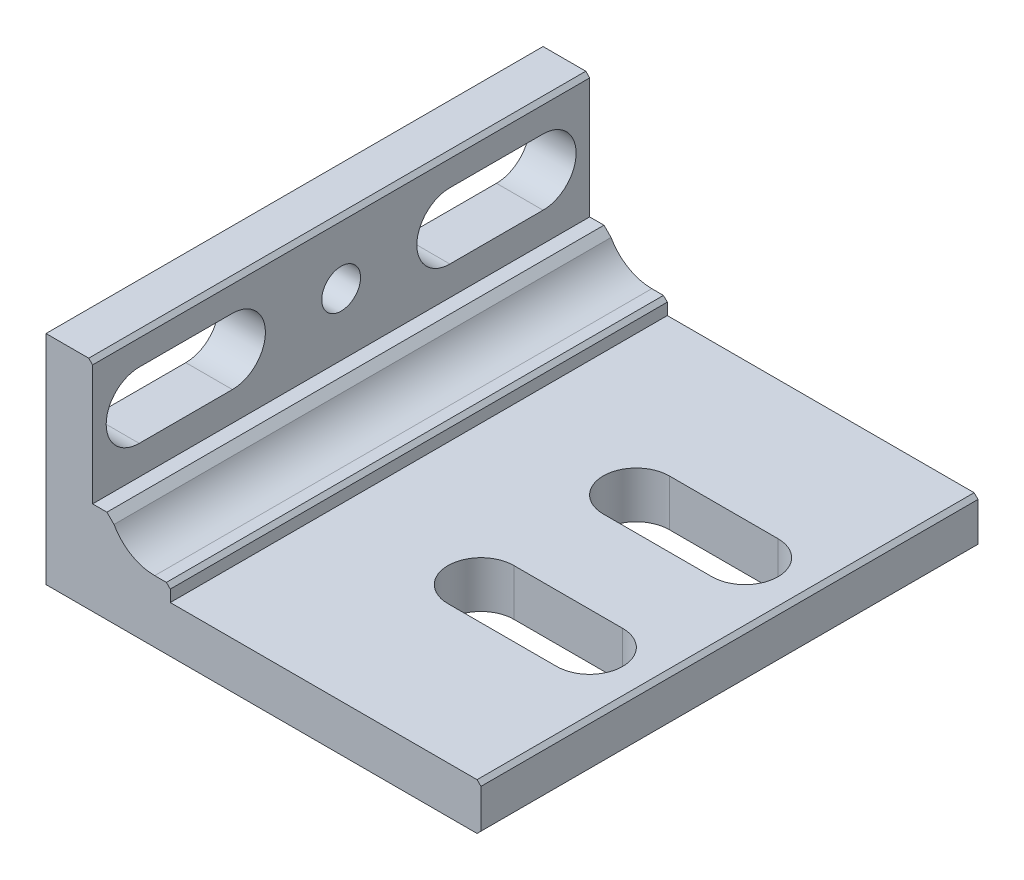
ISO-10303-21;
HEADER;
FILE_DESCRIPTION(('STEP AP214'),'2;1');
FILE_NAME('part.step','',(''),(''),'','','');
FILE_SCHEMA(('AUTOMOTIVE_DESIGN { 1 0 10303 214 1 1 1 1 }'));
ENDSEC;
DATA;
#1=APPLICATION_CONTEXT('core data for automotive mechanical design processes');
#2=APPLICATION_PROTOCOL_DEFINITION('international standard','automotive_design',2000,#1);
#3=PRODUCT_CONTEXT('',#1,'mechanical');
#4=PRODUCT('Part','Part','',(#3));
#5=PRODUCT_RELATED_PRODUCT_CATEGORY('part','',(#4));
#6=PRODUCT_DEFINITION_FORMATION('','',#4);
#7=PRODUCT_DEFINITION_CONTEXT('part definition',#1,'design');
#8=PRODUCT_DEFINITION('design','',#6,#7);
#9=PRODUCT_DEFINITION_SHAPE('','',#8);
#10=(LENGTH_UNIT() NAMED_UNIT(*) SI_UNIT(.MILLI.,.METRE.));
#11=(NAMED_UNIT(*) PLANE_ANGLE_UNIT() SI_UNIT($,.RADIAN.));
#12=(NAMED_UNIT(*) SI_UNIT($,.STERADIAN.) SOLID_ANGLE_UNIT());
#13=UNCERTAINTY_MEASURE_WITH_UNIT(LENGTH_MEASURE(1.E-05),#10,'distance_accuracy_value','');
#14=(GEOMETRIC_REPRESENTATION_CONTEXT(3) GLOBAL_UNCERTAINTY_ASSIGNED_CONTEXT((#13)) GLOBAL_UNIT_ASSIGNED_CONTEXT((#10,
#11,#12)) REPRESENTATION_CONTEXT('',''));
#15=CARTESIAN_POINT('',(0.,0.,0.));
#16=DIRECTION('',(0.,0.,1.));
#17=DIRECTION('',(1.,0.,0.));
#18=AXIS2_PLACEMENT_3D('',#15,#16,#17);
#19=CARTESIAN_POINT('',(0.,0.,50.8));
#20=DIRECTION('',(1.,0.,0.));
#21=DIRECTION('',(0.,0.,-1.));
#22=AXIS2_PLACEMENT_3D('',#19,#20,#21);
#23=PLANE('',#22);
#24=CARTESIAN_POINT('',(0.,31.75,0.));
#25=DIRECTION('',(1.,0.,0.));
#26=DIRECTION('',(0.,0.,-1.));
#27=AXIS2_PLACEMENT_3D('',#24,#25,#26);
#28=CIRCLE('',#27,3.96874999999999);
#29=CARTESIAN_POINT('',(0.,31.75,-3.96874999999999));
#30=VERTEX_POINT('',#29);
#31=EDGE_CURVE('E724',#30,#30,#28,.T.);
#32=ORIENTED_EDGE('',*,*,#31,.T.);
#33=EDGE_LOOP('',(#32));
#34=FACE_BOUND('',#33,.T.);
#35=DIRECTION('',(0.,0.,1.));
#36=VECTOR('',#35,1.);
#37=CARTESIAN_POINT('',(0.,44.45,50.8));
#38=LINE('',#37,#36);
#39=CARTESIAN_POINT('',(0.,44.45,-50.8));
#40=VERTEX_POINT('',#39);
#41=CARTESIAN_POINT('',(0.,44.45,50.8));
#42=VERTEX_POINT('',#41);
#43=EDGE_CURVE('E398',#40,#42,#38,.T.);
#44=ORIENTED_EDGE('',*,*,#43,.F.);
#45=DIRECTION('',(0.,-1.,0.));
#46=VECTOR('',#45,1.);
#47=CARTESIAN_POINT('',(0.,0.,-50.8));
#48=LINE('',#47,#46);
#49=CARTESIAN_POINT('',(0.,0.,-50.8));
#50=VERTEX_POINT('',#49);
#51=EDGE_CURVE('E408',#40,#50,#48,.T.);
#52=ORIENTED_EDGE('',*,*,#51,.T.);
#53=DIRECTION('',(0.,0.,-1.));
#54=VECTOR('',#53,1.);
#55=CARTESIAN_POINT('',(0.,0.,50.8));
#56=LINE('',#55,#54);
#57=CARTESIAN_POINT('',(0.,0.,50.8));
#58=VERTEX_POINT('',#57);
#59=EDGE_CURVE('E415',#58,#50,#56,.T.);
#60=ORIENTED_EDGE('',*,*,#59,.F.);
#61=DIRECTION('',(0.,-1.,0.));
#62=VECTOR('',#61,1.);
#63=CARTESIAN_POINT('',(0.,0.,50.8));
#64=LINE('',#63,#62);
#65=EDGE_CURVE('E413',#42,#58,#64,.T.);
#66=ORIENTED_EDGE('',*,*,#65,.F.);
#67=EDGE_LOOP('',(#44,#52,#60,#66));
#68=FACE_BOUND('',#67,.T.);
#69=DIRECTION('',(0.,0.,1.));
#70=VECTOR('',#69,1.);
#71=CARTESIAN_POINT('',(0.,38.496875,-22.225));
#72=LINE('',#71,#70);
#73=CARTESIAN_POINT('',(0.,38.496875,-41.275));
#74=VERTEX_POINT('',#73);
#75=CARTESIAN_POINT('',(0.,38.496875,-22.225));
#76=VERTEX_POINT('',#75);
#77=EDGE_CURVE('E282',#74,#76,#72,.T.);
#78=ORIENTED_EDGE('',*,*,#77,.T.);
#79=CARTESIAN_POINT('',(0.,31.75,-22.225));
#80=DIRECTION('',(1.,0.,0.));
#81=DIRECTION('',(0.,1.,0.));
#82=AXIS2_PLACEMENT_3D('',#79,#80,#81);
#83=CIRCLE('',#82,6.74687499999999);
#84=CARTESIAN_POINT('',(0.,25.003125,-22.225));
#85=VERTEX_POINT('',#84);
#86=EDGE_CURVE('E272',#76,#85,#83,.T.);
#87=ORIENTED_EDGE('',*,*,#86,.T.);
#88=DIRECTION('',(0.,0.,-1.));
#89=VECTOR('',#88,1.);
#90=CARTESIAN_POINT('',(0.,25.003125,-22.225));
#91=LINE('',#90,#89);
#92=CARTESIAN_POINT('',(0.,25.003125,-41.275));
#93=VERTEX_POINT('',#92);
#94=EDGE_CURVE('E275',#85,#93,#91,.T.);
#95=ORIENTED_EDGE('',*,*,#94,.T.);
#96=CARTESIAN_POINT('',(0.,31.75,-41.275));
#97=DIRECTION('',(1.,0.,0.));
#98=DIRECTION('',(0.,1.,0.));
#99=AXIS2_PLACEMENT_3D('',#96,#97,#98);
#100=CIRCLE('',#99,6.74687499999999);
#101=EDGE_CURVE('E279',#93,#74,#100,.T.);
#102=ORIENTED_EDGE('',*,*,#101,.T.);
#103=EDGE_LOOP('',(#78,#87,#95,#102));
#104=FACE_BOUND('',#103,.T.);
#105=CARTESIAN_POINT('',(0.,31.75,22.225));
#106=DIRECTION('',(-1.,0.,0.));
#107=DIRECTION('',(0.,1.,0.));
#108=AXIS2_PLACEMENT_3D('',#105,#106,#107);
#109=CIRCLE('',#108,6.74687499999999);
#110=CARTESIAN_POINT('',(0.,38.496875,22.225));
#111=VERTEX_POINT('',#110);
#112=CARTESIAN_POINT('',(0.,25.003125,22.225));
#113=VERTEX_POINT('',#112);
#114=EDGE_CURVE('E243',#111,#113,#109,.T.);
#115=ORIENTED_EDGE('',*,*,#114,.F.);
#116=DIRECTION('',(0.,0.,-1.));
#117=VECTOR('',#116,1.);
#118=CARTESIAN_POINT('',(0.,38.496875,22.225));
#119=LINE('',#118,#117);
#120=CARTESIAN_POINT('',(0.,38.496875,41.275));
#121=VERTEX_POINT('',#120);
#122=EDGE_CURVE('E235',#121,#111,#119,.T.);
#123=ORIENTED_EDGE('',*,*,#122,.F.);
#124=CARTESIAN_POINT('',(0.,31.75,41.275));
#125=DIRECTION('',(-1.,0.,0.));
#126=DIRECTION('',(0.,1.,0.));
#127=AXIS2_PLACEMENT_3D('',#124,#125,#126);
#128=CIRCLE('',#127,6.74687499999999);
#129=CARTESIAN_POINT('',(0.,25.003125,41.275));
#130=VERTEX_POINT('',#129);
#131=EDGE_CURVE('E242',#130,#121,#128,.T.);
#132=ORIENTED_EDGE('',*,*,#131,.F.);
#133=DIRECTION('',(0.,0.,1.));
#134=VECTOR('',#133,1.);
#135=CARTESIAN_POINT('',(0.,25.003125,22.225));
#136=LINE('',#135,#134);
#137=EDGE_CURVE('E247',#113,#130,#136,.T.);
#138=ORIENTED_EDGE('',*,*,#137,.F.);
#139=EDGE_LOOP('',(#115,#123,#132,#138));
#140=FACE_BOUND('',#139,.T.);
#141=ADVANCED_FACE('F32',(#34,#68,#104,#140),#23,.F.);
#142=CARTESIAN_POINT('',(9.52500000000001,47.625,50.8));
#143=DIRECTION('',(-1.,0.,0.));
#144=DIRECTION('',(0.,-1.,0.));
#145=AXIS2_PLACEMENT_3D('',#142,#143,#144);
#146=PLANE('',#145);
#147=CARTESIAN_POINT('',(9.52500000000001,31.75,0.));
#148=DIRECTION('',(1.,0.,0.));
#149=DIRECTION('',(0.,0.,-1.));
#150=AXIS2_PLACEMENT_3D('',#147,#148,#149);
#151=CIRCLE('',#150,3.96874999999999);
#152=CARTESIAN_POINT('',(9.52500000000001,31.75,-3.96874999999999));
#153=VERTEX_POINT('',#152);
#154=EDGE_CURVE('E256',#153,#153,#151,.T.);
#155=ORIENTED_EDGE('',*,*,#154,.F.);
#156=EDGE_LOOP('',(#155));
#157=FACE_BOUND('',#156,.T.);
#158=DIRECTION('',(0.,1.,0.));
#159=VECTOR('',#158,1.);
#160=CARTESIAN_POINT('',(9.52500000000001,47.625,-50.8));
#161=LINE('',#160,#159);
#162=CARTESIAN_POINT('',(9.525,19.05,-50.8));
#163=VERTEX_POINT('',#162);
#164=CARTESIAN_POINT('',(9.52500000000001,43.65625,-50.8));
#165=VERTEX_POINT('',#164);
#166=EDGE_CURVE('E307',#163,#165,#161,.T.);
#167=ORIENTED_EDGE('',*,*,#166,.T.);
#168=DIRECTION('',(0.,0.,1.));
#169=VECTOR('',#168,1.);
#170=CARTESIAN_POINT('',(9.52500000000001,43.65625,50.8));
#171=LINE('',#170,#169);
#172=CARTESIAN_POINT('',(9.52500000000001,43.65625,50.8));
#173=VERTEX_POINT('',#172);
#174=EDGE_CURVE('E434',#165,#173,#171,.T.);
#175=ORIENTED_EDGE('',*,*,#174,.T.);
#176=DIRECTION('',(0.,1.,0.));
#177=VECTOR('',#176,1.);
#178=CARTESIAN_POINT('',(9.52500000000001,47.625,50.8));
#179=LINE('',#178,#177);
#180=CARTESIAN_POINT('',(9.525,19.05,50.8));
#181=VERTEX_POINT('',#180);
#182=EDGE_CURVE('E306',#181,#173,#179,.T.);
#183=ORIENTED_EDGE('',*,*,#182,.F.);
#184=DIRECTION('',(0.,0.,-1.));
#185=VECTOR('',#184,1.);
#186=CARTESIAN_POINT('',(9.525,19.05,50.8));
#187=LINE('',#186,#185);
#188=EDGE_CURVE('E310',#181,#163,#187,.T.);
#189=ORIENTED_EDGE('',*,*,#188,.T.);
#190=EDGE_LOOP('',(#167,#175,#183,#189));
#191=FACE_BOUND('',#190,.T.);
#192=DIRECTION('',(0.,0.,-1.));
#193=VECTOR('',#192,1.);
#194=CARTESIAN_POINT('',(9.525,25.003125,-22.225));
#195=LINE('',#194,#193);
#196=CARTESIAN_POINT('',(9.525,25.003125,-22.225));
#197=VERTEX_POINT('',#196);
#198=CARTESIAN_POINT('',(9.525,25.003125,-41.275));
#199=VERTEX_POINT('',#198);
#200=EDGE_CURVE('E287',#197,#199,#195,.T.);
#201=ORIENTED_EDGE('',*,*,#200,.F.);
#202=CARTESIAN_POINT('',(9.525,31.75,-22.225));
#203=DIRECTION('',(1.,0.,0.));
#204=DIRECTION('',(0.,1.,0.));
#205=AXIS2_PLACEMENT_3D('',#202,#203,#204);
#206=CIRCLE('',#205,6.74687499999999);
#207=CARTESIAN_POINT('',(9.52500000000001,38.496875,-22.225));
#208=VERTEX_POINT('',#207);
#209=EDGE_CURVE('E268',#208,#197,#206,.T.);
#210=ORIENTED_EDGE('',*,*,#209,.F.);
#211=DIRECTION('',(0.,0.,1.));
#212=VECTOR('',#211,1.);
#213=CARTESIAN_POINT('',(9.52500000000001,38.496875,-22.225));
#214=LINE('',#213,#212);
#215=CARTESIAN_POINT('',(9.525,38.496875,-41.275));
#216=VERTEX_POINT('',#215);
#217=EDGE_CURVE('E276',#216,#208,#214,.T.);
#218=ORIENTED_EDGE('',*,*,#217,.F.);
#219=CARTESIAN_POINT('',(9.525,31.75,-41.275));
#220=DIRECTION('',(1.,0.,0.));
#221=DIRECTION('',(0.,1.,0.));
#222=AXIS2_PLACEMENT_3D('',#219,#220,#221);
#223=CIRCLE('',#222,6.74687499999999);
#224=EDGE_CURVE('E290',#199,#216,#223,.T.);
#225=ORIENTED_EDGE('',*,*,#224,.F.);
#226=EDGE_LOOP('',(#201,#210,#218,#225));
#227=FACE_BOUND('',#226,.T.);
#228=CARTESIAN_POINT('',(9.525,31.75,22.225));
#229=DIRECTION('',(-1.,0.,0.));
#230=DIRECTION('',(0.,1.,0.));
#231=AXIS2_PLACEMENT_3D('',#228,#229,#230);
#232=CIRCLE('',#231,6.74687499999999);
#233=CARTESIAN_POINT('',(9.525,38.496875,22.225));
#234=VERTEX_POINT('',#233);
#235=CARTESIAN_POINT('',(9.525,25.003125,22.225));
#236=VERTEX_POINT('',#235);
#237=EDGE_CURVE('E55',#234,#236,#232,.T.);
#238=ORIENTED_EDGE('',*,*,#237,.T.);
#239=DIRECTION('',(0.,0.,1.));
#240=VECTOR('',#239,1.);
#241=CARTESIAN_POINT('',(9.525,25.003125,22.225));
#242=LINE('',#241,#240);
#243=CARTESIAN_POINT('',(9.525,25.003125,41.275));
#244=VERTEX_POINT('',#243);
#245=EDGE_CURVE('E250',#236,#244,#242,.T.);
#246=ORIENTED_EDGE('',*,*,#245,.T.);
#247=CARTESIAN_POINT('',(9.525,31.75,41.275));
#248=DIRECTION('',(-1.,0.,0.));
#249=DIRECTION('',(0.,1.,0.));
#250=AXIS2_PLACEMENT_3D('',#247,#248,#249);
#251=CIRCLE('',#250,6.74687499999999);
#252=CARTESIAN_POINT('',(9.525,38.496875,41.275));
#253=VERTEX_POINT('',#252);
#254=EDGE_CURVE('E253',#244,#253,#251,.T.);
#255=ORIENTED_EDGE('',*,*,#254,.T.);
#256=DIRECTION('',(0.,0.,-1.));
#257=VECTOR('',#256,1.);
#258=CARTESIAN_POINT('',(9.52500000000001,38.496875,22.225));
#259=LINE('',#258,#257);
#260=EDGE_CURVE('E262',#253,#234,#259,.T.);
#261=ORIENTED_EDGE('',*,*,#260,.T.);
#262=EDGE_LOOP('',(#238,#246,#255,#261));
#263=FACE_BOUND('',#262,.T.);
#264=ADVANCED_FACE('F534',(#157,#191,#227,#263),#146,.F.);
#265=CARTESIAN_POINT('',(101.6,0.,50.8));
#266=DIRECTION('',(0.,1.,0.));
#267=DIRECTION('',(-1.,0.,0.));
#268=AXIS2_PLACEMENT_3D('',#265,#266,#267);
#269=PLANE('',#268);
#270=DIRECTION('',(1.,0.,0.));
#271=VECTOR('',#270,1.);
#272=CARTESIAN_POINT('',(101.6,0.,-50.8));
#273=LINE('',#272,#271);
#274=CARTESIAN_POINT('',(88.10625,0.,-50.8));
#275=VERTEX_POINT('',#274);
#276=EDGE_CURVE('E403',#50,#275,#273,.T.);
#277=ORIENTED_EDGE('',*,*,#276,.T.);
#278=DIRECTION('',(0.,0.,1.));
#279=VECTOR('',#278,1.);
#280=CARTESIAN_POINT('',(88.10625,0.,50.8));
#281=LINE('',#280,#279);
#282=CARTESIAN_POINT('',(88.10625,0.,50.8));
#283=VERTEX_POINT('',#282);
#284=EDGE_CURVE('E40',#275,#283,#281,.T.);
#285=ORIENTED_EDGE('',*,*,#284,.T.);
#286=DIRECTION('',(1.,0.,0.));
#287=VECTOR('',#286,1.);
#288=CARTESIAN_POINT('',(101.6,0.,50.8));
#289=LINE('',#288,#287);
#290=EDGE_CURVE('E404',#58,#283,#289,.T.);
#291=ORIENTED_EDGE('',*,*,#290,.F.);
#292=ORIENTED_EDGE('',*,*,#59,.T.);
#293=EDGE_LOOP('',(#277,#285,#291,#292));
#294=FACE_BOUND('',#293,.T.);
#295=DIRECTION('',(1.,0.,0.));
#296=VECTOR('',#295,1.);
#297=CARTESIAN_POINT('',(53.975,0.,-9.12875999999999));
#298=LINE('',#297,#296);
#299=CARTESIAN_POINT('',(53.975,0.,-9.12875999999999));
#300=VERTEX_POINT('',#299);
#301=CARTESIAN_POINT('',(76.2,0.,-9.12876));
#302=VERTEX_POINT('',#301);
#303=EDGE_CURVE('E377',#300,#302,#298,.T.);
#304=ORIENTED_EDGE('',*,*,#303,.T.);
#305=CARTESIAN_POINT('',(76.2,0.,-15.875));
#306=DIRECTION('',(0.,1.,0.));
#307=DIRECTION('',(0.,0.,1.));
#308=AXIS2_PLACEMENT_3D('',#305,#306,#307);
#309=CIRCLE('',#308,6.74624);
#310=CARTESIAN_POINT('',(76.2,0.,-22.62124));
#311=VERTEX_POINT('',#310);
#312=EDGE_CURVE('E360',#302,#311,#309,.T.);
#313=ORIENTED_EDGE('',*,*,#312,.T.);
#314=DIRECTION('',(-1.,0.,0.));
#315=VECTOR('',#314,1.);
#316=CARTESIAN_POINT('',(76.2,0.,-22.62124));
#317=LINE('',#316,#315);
#318=CARTESIAN_POINT('',(53.975,0.,-22.62124));
#319=VERTEX_POINT('',#318);
#320=EDGE_CURVE('E371',#311,#319,#317,.T.);
#321=ORIENTED_EDGE('',*,*,#320,.T.);
#322=CARTESIAN_POINT('',(53.975,0.,-15.875));
#323=DIRECTION('',(0.,1.,0.));
#324=DIRECTION('',(0.,0.,1.));
#325=AXIS2_PLACEMENT_3D('',#322,#323,#324);
#326=CIRCLE('',#325,6.74624000000001);
#327=EDGE_CURVE('E374',#319,#300,#326,.T.);
#328=ORIENTED_EDGE('',*,*,#327,.T.);
#329=EDGE_LOOP('',(#304,#313,#321,#328));
#330=FACE_BOUND('',#329,.T.);
#331=CARTESIAN_POINT('',(76.2,0.,15.875));
#332=DIRECTION('',(0.,-1.,0.));
#333=DIRECTION('',(0.,0.,-1.));
#334=AXIS2_PLACEMENT_3D('',#331,#332,#333);
#335=CIRCLE('',#334,6.74624);
#336=CARTESIAN_POINT('',(76.2,0.,9.12876));
#337=VERTEX_POINT('',#336);
#338=CARTESIAN_POINT('',(76.2,0.,22.62124));
#339=VERTEX_POINT('',#338);
#340=EDGE_CURVE('E347',#337,#339,#335,.T.);
#341=ORIENTED_EDGE('',*,*,#340,.F.);
#342=DIRECTION('',(1.,0.,0.));
#343=VECTOR('',#342,1.);
#344=CARTESIAN_POINT('',(53.975,0.,9.12875999999999));
#345=LINE('',#344,#343);
#346=CARTESIAN_POINT('',(53.975,0.,9.12875999999999));
#347=VERTEX_POINT('',#346);
#348=EDGE_CURVE('E349',#347,#337,#345,.T.);
#349=ORIENTED_EDGE('',*,*,#348,.F.);
#350=CARTESIAN_POINT('',(53.975,0.,15.875));
#351=DIRECTION('',(0.,-1.,0.));
#352=DIRECTION('',(0.,0.,-1.));
#353=AXIS2_PLACEMENT_3D('',#350,#351,#352);
#354=CIRCLE('',#353,6.74624000000001);
#355=CARTESIAN_POINT('',(53.975,0.,22.62124));
#356=VERTEX_POINT('',#355);
#357=EDGE_CURVE('E351',#356,#347,#354,.T.);
#358=ORIENTED_EDGE('',*,*,#357,.F.);
#359=DIRECTION('',(-1.,0.,0.));
#360=VECTOR('',#359,1.);
#361=CARTESIAN_POINT('',(76.2,0.,22.62124));
#362=LINE('',#361,#360);
#363=EDGE_CURVE('E354',#339,#356,#362,.T.);
#364=ORIENTED_EDGE('',*,*,#363,.F.);
#365=EDGE_LOOP('',(#341,#349,#358,#364));
#366=FACE_BOUND('',#365,.T.);
#367=ADVANCED_FACE('F476',(#294,#330,#366),#269,.F.);
#368=CARTESIAN_POINT('',(22.225,12.7,50.8));
#369=DIRECTION('',(0.,-1.,0.));
#370=DIRECTION('',(0.,0.,-1.));
#371=AXIS2_PLACEMENT_3D('',#368,#369,#370);
#372=PLANE('',#371);
#373=DIRECTION('',(-1.,0.,0.));
#374=VECTOR('',#373,1.);
#375=CARTESIAN_POINT('',(22.225,12.7,50.8));
#376=LINE('',#375,#374);
#377=CARTESIAN_POINT('',(24.60625,12.7,50.8));
#378=VERTEX_POINT('',#377);
#379=CARTESIAN_POINT('',(22.225,12.7,50.8));
#380=VERTEX_POINT('',#379);
#381=EDGE_CURVE('E407',#378,#380,#376,.T.);
#382=ORIENTED_EDGE('',*,*,#381,.F.);
#383=DIRECTION('',(0.,0.,-1.));
#384=VECTOR('',#383,1.);
#385=CARTESIAN_POINT('',(24.60625,12.7,50.8));
#386=LINE('',#385,#384);
#387=CARTESIAN_POINT('',(24.60625,12.7,-50.8));
#388=VERTEX_POINT('',#387);
#389=EDGE_CURVE('E464',#378,#388,#386,.T.);
#390=ORIENTED_EDGE('',*,*,#389,.T.);
#391=DIRECTION('',(-1.,0.,0.));
#392=VECTOR('',#391,1.);
#393=CARTESIAN_POINT('',(22.225,12.7,-50.8));
#394=LINE('',#393,#392);
#395=CARTESIAN_POINT('',(22.225,12.7,-50.8));
#396=VERTEX_POINT('',#395);
#397=EDGE_CURVE('E418',#388,#396,#394,.T.);
#398=ORIENTED_EDGE('',*,*,#397,.T.);
#399=DIRECTION('',(0.,0.,-1.));
#400=VECTOR('',#399,1.);
#401=CARTESIAN_POINT('',(22.225,12.7,50.8));
#402=LINE('',#401,#400);
#403=EDGE_CURVE('E426',#380,#396,#402,.T.);
#404=ORIENTED_EDGE('',*,*,#403,.F.);
#405=EDGE_LOOP('',(#382,#390,#398,#404));
#406=FACE_BOUND('',#405,.T.);
#407=ADVANCED_FACE('F515',(#406),#372,.F.);
#408=CARTESIAN_POINT('',(3.18008,92.08008,50.8));
#409=DIRECTION('',(0.,0.,-1.));
#410=DIRECTION('',(-1.,0.,0.));
#411=AXIS2_PLACEMENT_3D('',#408,#409,#410);
#412=PLANE('',#411);
#413=ORIENTED_EDGE('',*,*,#182,.T.);
#414=DIRECTION('',(-0.707106781186546,0.707106781186549,0.));
#415=VECTOR('',#414,1.);
#416=CARTESIAN_POINT('',(9.52500000000001,43.65625,50.8));
#417=LINE('',#416,#415);
#418=CARTESIAN_POINT('',(8.73125000000001,44.45,50.8));
#419=VERTEX_POINT('',#418);
#420=EDGE_CURVE('E445',#173,#419,#417,.T.);
#421=ORIENTED_EDGE('',*,*,#420,.T.);
#422=DIRECTION('',(1.,0.,0.));
#423=VECTOR('',#422,1.);
#424=CARTESIAN_POINT('',(3.18008,44.45,50.8));
#425=LINE('',#424,#423);
#426=EDGE_CURVE('E400',#42,#419,#425,.T.);
#427=ORIENTED_EDGE('',*,*,#426,.F.);
#428=ORIENTED_EDGE('',*,*,#65,.T.);
#429=ORIENTED_EDGE('',*,*,#290,.T.);
#430=DIRECTION('',(0.707106781186547,0.707106781186548,0.));
#431=VECTOR('',#430,1.);
#432=CARTESIAN_POINT('',(88.9,0.793750000000003,50.8));
#433=LINE('',#432,#431);
#434=CARTESIAN_POINT('',(88.9,0.793750000000018,50.8));
#435=VERTEX_POINT('',#434);
#436=EDGE_CURVE('E439',#283,#435,#433,.T.);
#437=ORIENTED_EDGE('',*,*,#436,.T.);
#438=DIRECTION('',(0.,-1.,0.));
#439=VECTOR('',#438,1.);
#440=CARTESIAN_POINT('',(88.9,92.08008,50.8));
#441=LINE('',#440,#439);
#442=CARTESIAN_POINT('',(88.9,8.73125000000003,50.8));
#443=VERTEX_POINT('',#442);
#444=EDGE_CURVE('E395',#443,#435,#441,.T.);
#445=ORIENTED_EDGE('',*,*,#444,.F.);
#446=DIRECTION('',(-0.707106781186546,0.707106781186549,0.));
#447=VECTOR('',#446,1.);
#448=CARTESIAN_POINT('',(88.10625,9.525,50.8));
#449=LINE('',#448,#447);
#450=CARTESIAN_POINT('',(88.10625,9.525,50.8));
#451=VERTEX_POINT('',#450);
#452=EDGE_CURVE('E437',#443,#451,#449,.T.);
#453=ORIENTED_EDGE('',*,*,#452,.T.);
#454=DIRECTION('',(-1.,0.,0.));
#455=VECTOR('',#454,1.);
#456=CARTESIAN_POINT('',(92.075,9.525,50.8));
#457=LINE('',#456,#455);
#458=CARTESIAN_POINT('',(25.4,9.525,50.8));
#459=VERTEX_POINT('',#458);
#460=EDGE_CURVE('E317',#451,#459,#457,.T.);
#461=ORIENTED_EDGE('',*,*,#460,.T.);
#462=DIRECTION('',(0.,1.,0.));
#463=VECTOR('',#462,1.);
#464=CARTESIAN_POINT('',(25.4,15.875,50.8));
#465=LINE('',#464,#463);
#466=CARTESIAN_POINT('',(25.4,11.90625,50.8));
#467=VERTEX_POINT('',#466);
#468=EDGE_CURVE('E319',#459,#467,#465,.T.);
#469=ORIENTED_EDGE('',*,*,#468,.T.);
#470=DIRECTION('',(0.707106781186546,-0.707106781186549,0.));
#471=VECTOR('',#470,1.);
#472=CARTESIAN_POINT('',(24.60625,12.7,50.8));
#473=LINE('',#472,#471);
#474=EDGE_CURVE('E441',#467,#378,#473,.F.);
#475=ORIENTED_EDGE('',*,*,#474,.T.);
#476=ORIENTED_EDGE('',*,*,#381,.T.);
#477=CARTESIAN_POINT('',(22.225,22.225,50.8));
#478=DIRECTION('',(0.,0.,-1.));
#479=DIRECTION('',(-1.,0.,0.));
#480=AXIS2_PLACEMENT_3D('',#477,#478,#479);
#481=CIRCLE('',#480,9.525);
#482=CARTESIAN_POINT('',(13.894796904673,17.6061969742578,50.8));
#483=VERTEX_POINT('',#482);
#484=EDGE_CURVE('E410',#380,#483,#481,.T.);
#485=ORIENTED_EDGE('',*,*,#484,.T.);
#486=DIRECTION('',(-0.70710678118655,0.707106781186545,0.));
#487=VECTOR('',#486,1.);
#488=CARTESIAN_POINT('',(13.894796904673,17.6061969742578,50.8));
#489=LINE('',#488,#487);
#490=CARTESIAN_POINT('',(12.4509938789308,19.05,50.8));
#491=VERTEX_POINT('',#490);
#492=EDGE_CURVE('E443',#483,#491,#489,.T.);
#493=ORIENTED_EDGE('',*,*,#492,.T.);
#494=DIRECTION('',(-1.,0.,0.));
#495=VECTOR('',#494,1.);
#496=CARTESIAN_POINT('',(19.05,19.05,50.8));
#497=LINE('',#496,#495);
#498=EDGE_CURVE('E304',#491,#181,#497,.T.);
#499=ORIENTED_EDGE('',*,*,#498,.T.);
#500=EDGE_LOOP('',(#413,#421,#427,#428,#429,#437,#445,#453,#461,#469,#475,#476,#485,#493,#499));
#501=FACE_BOUND('',#500,.T.);
#502=ADVANCED_FACE('F482',(#501),#412,.F.);
#503=CARTESIAN_POINT('',(3.18008,92.08008,-50.8));
#504=DIRECTION('',(0.,0.,-1.));
#505=DIRECTION('',(-1.,0.,0.));
#506=AXIS2_PLACEMENT_3D('',#503,#504,#505);
#507=PLANE('',#506);
#508=DIRECTION('',(1.,0.,0.));
#509=VECTOR('',#508,1.);
#510=CARTESIAN_POINT('',(3.18008,44.45,-50.8));
#511=LINE('',#510,#509);
#512=CARTESIAN_POINT('',(8.73125000000002,44.45,-50.8));
#513=VERTEX_POINT('',#512);
#514=EDGE_CURVE('E429',#40,#513,#511,.T.);
#515=ORIENTED_EDGE('',*,*,#514,.T.);
#516=DIRECTION('',(0.707106781186546,-0.707106781186549,0.));
#517=VECTOR('',#516,1.);
#518=CARTESIAN_POINT('',(-17.859375,71.0406250000001,-50.8));
#519=LINE('',#518,#517);
#520=EDGE_CURVE('E457',#513,#165,#519,.T.);
#521=ORIENTED_EDGE('',*,*,#520,.T.);
#522=ORIENTED_EDGE('',*,*,#166,.F.);
#523=DIRECTION('',(-1.,0.,0.));
#524=VECTOR('',#523,1.);
#525=CARTESIAN_POINT('',(19.05,19.05,-50.8));
#526=LINE('',#525,#524);
#527=CARTESIAN_POINT('',(12.4509938789308,19.05,-50.8));
#528=VERTEX_POINT('',#527);
#529=EDGE_CURVE('E297',#528,#163,#526,.T.);
#530=ORIENTED_EDGE('',*,*,#529,.F.);
#531=DIRECTION('',(0.70710678118655,-0.707106781186545,0.));
#532=VECTOR('',#531,1.);
#533=CARTESIAN_POINT('',(-28.6995030605346,60.2004969394652,-50.8));
#534=LINE('',#533,#532);
#535=CARTESIAN_POINT('',(13.8947969046731,17.6061969742578,-50.8));
#536=VERTEX_POINT('',#535);
#537=EDGE_CURVE('E455',#528,#536,#534,.T.);
#538=ORIENTED_EDGE('',*,*,#537,.T.);
#539=CARTESIAN_POINT('',(22.225,22.225,-50.8));
#540=DIRECTION('',(0.,0.,-1.));
#541=DIRECTION('',(-1.,0.,0.));
#542=AXIS2_PLACEMENT_3D('',#539,#540,#541);
#543=CIRCLE('',#542,9.525);
#544=EDGE_CURVE('E420',#396,#536,#543,.T.);
#545=ORIENTED_EDGE('',*,*,#544,.F.);
#546=ORIENTED_EDGE('',*,*,#397,.F.);
#547=DIRECTION('',(-0.707106781186546,0.707106781186549,0.));
#548=VECTOR('',#547,1.);
#549=CARTESIAN_POINT('',(-25.796875,63.1031250000002,-50.8));
#550=LINE('',#549,#548);
#551=CARTESIAN_POINT('',(25.4,11.90625,-50.8));
#552=VERTEX_POINT('',#551);
#553=EDGE_CURVE('E453',#388,#552,#550,.F.);
#554=ORIENTED_EDGE('',*,*,#553,.T.);
#555=DIRECTION('',(0.,1.,0.));
#556=VECTOR('',#555,1.);
#557=CARTESIAN_POINT('',(25.4,15.875,-50.8));
#558=LINE('',#557,#556);
#559=CARTESIAN_POINT('',(25.4,9.525,-50.8));
#560=VERTEX_POINT('',#559);
#561=EDGE_CURVE('E320',#560,#552,#558,.T.);
#562=ORIENTED_EDGE('',*,*,#561,.F.);
#563=DIRECTION('',(-1.,0.,0.));
#564=VECTOR('',#563,1.);
#565=CARTESIAN_POINT('',(92.075,9.525,-50.8));
#566=LINE('',#565,#564);
#567=CARTESIAN_POINT('',(88.10625,9.525,-50.8));
#568=VERTEX_POINT('',#567);
#569=EDGE_CURVE('E316',#568,#560,#566,.T.);
#570=ORIENTED_EDGE('',*,*,#569,.F.);
#571=DIRECTION('',(0.707106781186546,-0.707106781186549,0.));
#572=VECTOR('',#571,1.);
#573=CARTESIAN_POINT('',(4.36562500000019,93.2656250000002,-50.8));
#574=LINE('',#573,#572);
#575=CARTESIAN_POINT('',(88.9,8.73125,-50.8));
#576=VERTEX_POINT('',#575);
#577=EDGE_CURVE('E449',#568,#576,#574,.T.);
#578=ORIENTED_EDGE('',*,*,#577,.T.);
#579=DIRECTION('',(0.,-1.,0.));
#580=VECTOR('',#579,1.);
#581=CARTESIAN_POINT('',(88.9,92.08008,-50.8));
#582=LINE('',#581,#580);
#583=CARTESIAN_POINT('',(88.9,0.793750000000018,-50.8));
#584=VERTEX_POINT('',#583);
#585=EDGE_CURVE('E384',#576,#584,#582,.T.);
#586=ORIENTED_EDGE('',*,*,#585,.T.);
#587=DIRECTION('',(-0.707106781186547,-0.707106781186548,0.));
#588=VECTOR('',#587,1.);
#589=CARTESIAN_POINT('',(91.6832050000001,3.57695500000009,-50.8));
#590=LINE('',#589,#588);
#591=EDGE_CURVE('E451',#584,#275,#590,.T.);
#592=ORIENTED_EDGE('',*,*,#591,.T.);
#593=ORIENTED_EDGE('',*,*,#276,.F.);
#594=ORIENTED_EDGE('',*,*,#51,.F.);
#595=EDGE_LOOP('',(#515,#521,#522,#530,#538,#545,#546,#554,#562,#570,#578,#586,#592,#593,#594));
#596=FACE_BOUND('',#595,.T.);
#597=ADVANCED_FACE('F494',(#596),#507,.T.);
#598=CARTESIAN_POINT('',(-4.11227174887305,44.45,397.770452561247));
#599=DIRECTION('',(0.,1.,0.));
#600=DIRECTION('',(0.,0.,1.));
#601=AXIS2_PLACEMENT_3D('',#598,#599,#600);
#602=PLANE('',#601);
#603=ORIENTED_EDGE('',*,*,#426,.T.);
#604=DIRECTION('',(0.,0.,-1.));
#605=VECTOR('',#604,1.);
#606=CARTESIAN_POINT('',(8.73125000000001,44.45,-50.8));
#607=LINE('',#606,#605);
#608=EDGE_CURVE('E447',#419,#513,#607,.T.);
#609=ORIENTED_EDGE('',*,*,#608,.T.);
#610=ORIENTED_EDGE('',*,*,#514,.F.);
#611=ORIENTED_EDGE('',*,*,#43,.T.);
#612=EDGE_LOOP('',(#603,#609,#610,#611));
#613=FACE_BOUND('',#612,.T.);
#614=ADVANCED_FACE('F540',(#613),#602,.T.);
#615=CARTESIAN_POINT('',(22.225,22.225,50.8));
#616=DIRECTION('',(0.,0.,-1.));
#617=DIRECTION('',(-1.,0.,0.));
#618=AXIS2_PLACEMENT_3D('',#615,#616,#617);
#619=CYLINDRICAL_SURFACE('',#618,9.525);
#620=ORIENTED_EDGE('',*,*,#544,.T.);
#621=DIRECTION('',(0.,0.,-1.));
#622=VECTOR('',#621,1.);
#623=CARTESIAN_POINT('',(13.894796904673,17.6061969742578,50.8));
#624=LINE('',#623,#622);
#625=EDGE_CURVE('E459',#536,#483,#624,.F.);
#626=ORIENTED_EDGE('',*,*,#625,.T.);
#627=ORIENTED_EDGE('',*,*,#484,.F.);
#628=ORIENTED_EDGE('',*,*,#403,.T.);
#629=EDGE_LOOP('',(#620,#626,#627,#628));
#630=FACE_BOUND('',#629,.T.);
#631=ADVANCED_FACE('F522',(#630),#619,.F.);
#632=CARTESIAN_POINT('',(88.9,19.3702274169598,238.803168606941));
#633=DIRECTION('',(1.,0.,0.));
#634=DIRECTION('',(0.,0.,-1.));
#635=AXIS2_PLACEMENT_3D('',#632,#633,#634);
#636=PLANE('',#635);
#637=ORIENTED_EDGE('',*,*,#444,.T.);
#638=DIRECTION('',(0.,0.,-1.));
#639=VECTOR('',#638,1.);
#640=CARTESIAN_POINT('',(88.9,0.793750000000003,-50.8));
#641=LINE('',#640,#639);
#642=EDGE_CURVE('E471',#435,#584,#641,.T.);
#643=ORIENTED_EDGE('',*,*,#642,.T.);
#644=ORIENTED_EDGE('',*,*,#585,.F.);
#645=DIRECTION('',(0.,0.,1.));
#646=VECTOR('',#645,1.);
#647=CARTESIAN_POINT('',(88.9,8.73125,50.8));
#648=LINE('',#647,#646);
#649=EDGE_CURVE('E469',#576,#443,#648,.T.);
#650=ORIENTED_EDGE('',*,*,#649,.T.);
#651=EDGE_LOOP('',(#637,#643,#644,#650));
#652=FACE_BOUND('',#651,.T.);
#653=ADVANCED_FACE('F491',(#652),#636,.T.);
#654=CARTESIAN_POINT('',(76.2,0.,-15.875));
#655=DIRECTION('',(0.,1.,0.));
#656=DIRECTION('',(0.,0.,1.));
#657=AXIS2_PLACEMENT_3D('',#654,#655,#656);
#658=CYLINDRICAL_SURFACE('',#657,6.74624);
#659=DIRECTION('',(0.,1.,0.));
#660=VECTOR('',#659,1.);
#661=CARTESIAN_POINT('',(76.2,0.,-9.12876));
#662=LINE('',#661,#660);
#663=CARTESIAN_POINT('',(76.2,9.525,-9.12876));
#664=VERTEX_POINT('',#663);
#665=EDGE_CURVE('E381',#302,#664,#662,.T.);
#666=ORIENTED_EDGE('',*,*,#665,.T.);
#667=CARTESIAN_POINT('',(76.2,9.525,-15.875));
#668=DIRECTION('',(0.,-1.,0.));
#669=DIRECTION('',(0.,0.,-1.));
#670=AXIS2_PLACEMENT_3D('',#667,#668,#669);
#671=CIRCLE('',#670,6.74624);
#672=CARTESIAN_POINT('',(76.2,9.525,-22.62124));
#673=VERTEX_POINT('',#672);
#674=EDGE_CURVE('E344',#664,#673,#671,.F.);
#675=ORIENTED_EDGE('',*,*,#674,.T.);
#676=DIRECTION('',(0.,1.,0.));
#677=VECTOR('',#676,1.);
#678=CARTESIAN_POINT('',(76.2,0.,-22.62124));
#679=LINE('',#678,#677);
#680=EDGE_CURVE('E380',#311,#673,#679,.T.);
#681=ORIENTED_EDGE('',*,*,#680,.F.);
#682=ORIENTED_EDGE('',*,*,#312,.F.);
#683=EDGE_LOOP('',(#666,#675,#681,#682));
#684=FACE_BOUND('',#683,.T.);
#685=ADVANCED_FACE('F625',(#684),#658,.F.);
#686=CARTESIAN_POINT('',(53.975,0.,-9.12875999999999));
#687=DIRECTION('',(0.,0.,1.));
#688=DIRECTION('',(1.,0.,0.));
#689=AXIS2_PLACEMENT_3D('',#686,#687,#688);
#690=PLANE('',#689);
#691=DIRECTION('',(0.,1.,0.));
#692=VECTOR('',#691,1.);
#693=CARTESIAN_POINT('',(53.975,0.,-9.12875999999999));
#694=LINE('',#693,#692);
#695=CARTESIAN_POINT('',(53.975,9.525,-9.12875999999999));
#696=VERTEX_POINT('',#695);
#697=EDGE_CURVE('E385',#300,#696,#694,.T.);
#698=ORIENTED_EDGE('',*,*,#697,.T.);
#699=DIRECTION('',(1.,0.,0.));
#700=VECTOR('',#699,1.);
#701=CARTESIAN_POINT('',(53.975,9.525,-9.12875999999999));
#702=LINE('',#701,#700);
#703=EDGE_CURVE('E341',#696,#664,#702,.T.);
#704=ORIENTED_EDGE('',*,*,#703,.T.);
#705=ORIENTED_EDGE('',*,*,#665,.F.);
#706=ORIENTED_EDGE('',*,*,#303,.F.);
#707=EDGE_LOOP('',(#698,#704,#705,#706));
#708=FACE_BOUND('',#707,.T.);
#709=ADVANCED_FACE('F621',(#708),#690,.F.);
#710=CARTESIAN_POINT('',(53.975,0.,-15.875));
#711=DIRECTION('',(0.,1.,0.));
#712=DIRECTION('',(0.,0.,1.));
#713=AXIS2_PLACEMENT_3D('',#710,#711,#712);
#714=CYLINDRICAL_SURFACE('',#713,6.74624000000001);
#715=DIRECTION('',(0.,1.,0.));
#716=VECTOR('',#715,1.);
#717=CARTESIAN_POINT('',(53.975,0.,-22.62124));
#718=LINE('',#717,#716);
#719=CARTESIAN_POINT('',(53.975,9.525,-22.62124));
#720=VERTEX_POINT('',#719);
#721=EDGE_CURVE('E388',#319,#720,#718,.T.);
#722=ORIENTED_EDGE('',*,*,#721,.T.);
#723=CARTESIAN_POINT('',(53.975,9.525,-15.875));
#724=DIRECTION('',(0.,-1.,0.));
#725=DIRECTION('',(0.,0.,-1.));
#726=AXIS2_PLACEMENT_3D('',#723,#724,#725);
#727=CIRCLE('',#726,6.74624000000001);
#728=EDGE_CURVE('E338',#720,#696,#727,.F.);
#729=ORIENTED_EDGE('',*,*,#728,.T.);
#730=ORIENTED_EDGE('',*,*,#697,.F.);
#731=ORIENTED_EDGE('',*,*,#327,.F.);
#732=EDGE_LOOP('',(#722,#729,#730,#731));
#733=FACE_BOUND('',#732,.T.);
#734=ADVANCED_FACE('F624',(#733),#714,.F.);
#735=CARTESIAN_POINT('',(76.2,0.,-22.62124));
#736=DIRECTION('',(0.,0.,-1.));
#737=DIRECTION('',(-1.,0.,0.));
#738=AXIS2_PLACEMENT_3D('',#735,#736,#737);
#739=PLANE('',#738);
#740=ORIENTED_EDGE('',*,*,#680,.T.);
#741=DIRECTION('',(-1.,0.,0.));
#742=VECTOR('',#741,1.);
#743=CARTESIAN_POINT('',(76.2,9.525,-22.62124));
#744=LINE('',#743,#742);
#745=EDGE_CURVE('E335',#673,#720,#744,.T.);
#746=ORIENTED_EDGE('',*,*,#745,.T.);
#747=ORIENTED_EDGE('',*,*,#721,.F.);
#748=ORIENTED_EDGE('',*,*,#320,.F.);
#749=EDGE_LOOP('',(#740,#746,#747,#748));
#750=FACE_BOUND('',#749,.T.);
#751=ADVANCED_FACE('F619',(#750),#739,.F.);
#752=CARTESIAN_POINT('',(76.2,0.,15.875));
#753=DIRECTION('',(0.,1.,0.));
#754=DIRECTION('',(0.,0.,1.));
#755=AXIS2_PLACEMENT_3D('',#752,#753,#754);
#756=CYLINDRICAL_SURFACE('',#755,6.74624);
#757=CARTESIAN_POINT('',(76.2,9.525,15.875));
#758=DIRECTION('',(0.,-1.,0.));
#759=DIRECTION('',(0.,0.,-1.));
#760=AXIS2_PLACEMENT_3D('',#757,#758,#759);
#761=CIRCLE('',#760,6.74624);
#762=CARTESIAN_POINT('',(76.2,9.525,9.12876));
#763=VERTEX_POINT('',#762);
#764=CARTESIAN_POINT('',(76.2,9.525,22.62124));
#765=VERTEX_POINT('',#764);
#766=EDGE_CURVE('E333',#763,#765,#761,.T.);
#767=ORIENTED_EDGE('',*,*,#766,.F.);
#768=DIRECTION('',(0.,1.,0.));
#769=VECTOR('',#768,1.);
#770=CARTESIAN_POINT('',(76.2,0.,9.12876));
#771=LINE('',#770,#769);
#772=EDGE_CURVE('E356',#337,#763,#771,.T.);
#773=ORIENTED_EDGE('',*,*,#772,.F.);
#774=ORIENTED_EDGE('',*,*,#340,.T.);
#775=DIRECTION('',(0.,1.,0.));
#776=VECTOR('',#775,1.);
#777=CARTESIAN_POINT('',(76.2,0.,22.62124));
#778=LINE('',#777,#776);
#779=EDGE_CURVE('E357',#339,#765,#778,.T.);
#780=ORIENTED_EDGE('',*,*,#779,.T.);
#781=EDGE_LOOP('',(#767,#773,#774,#780));
#782=FACE_BOUND('',#781,.T.);
#783=ADVANCED_FACE('F609',(#782),#756,.F.);
#784=CARTESIAN_POINT('',(76.2,0.,22.62124));
#785=DIRECTION('',(0.,0.,-1.));
#786=DIRECTION('',(-1.,0.,0.));
#787=AXIS2_PLACEMENT_3D('',#784,#785,#786);
#788=PLANE('',#787);
#789=DIRECTION('',(-1.,0.,0.));
#790=VECTOR('',#789,1.);
#791=CARTESIAN_POINT('',(76.2,9.525,22.62124));
#792=LINE('',#791,#790);
#793=CARTESIAN_POINT('',(53.975,9.525,22.62124));
#794=VERTEX_POINT('',#793);
#795=EDGE_CURVE('E331',#765,#794,#792,.T.);
#796=ORIENTED_EDGE('',*,*,#795,.F.);
#797=ORIENTED_EDGE('',*,*,#779,.F.);
#798=ORIENTED_EDGE('',*,*,#363,.T.);
#799=DIRECTION('',(0.,1.,0.));
#800=VECTOR('',#799,1.);
#801=CARTESIAN_POINT('',(53.975,0.,22.62124));
#802=LINE('',#801,#800);
#803=EDGE_CURVE('E361',#356,#794,#802,.T.);
#804=ORIENTED_EDGE('',*,*,#803,.T.);
#805=EDGE_LOOP('',(#796,#797,#798,#804));
#806=FACE_BOUND('',#805,.T.);
#807=ADVANCED_FACE('F605',(#806),#788,.T.);
#808=CARTESIAN_POINT('',(53.975,0.,15.875));
#809=DIRECTION('',(0.,1.,0.));
#810=DIRECTION('',(0.,0.,1.));
#811=AXIS2_PLACEMENT_3D('',#808,#809,#810);
#812=CYLINDRICAL_SURFACE('',#811,6.74624000000001);
#813=CARTESIAN_POINT('',(53.975,9.525,15.875));
#814=DIRECTION('',(0.,-1.,0.));
#815=DIRECTION('',(0.,0.,-1.));
#816=AXIS2_PLACEMENT_3D('',#813,#814,#815);
#817=CIRCLE('',#816,6.74624000000001);
#818=CARTESIAN_POINT('',(53.975,9.525,9.12875999999999));
#819=VERTEX_POINT('',#818);
#820=EDGE_CURVE('E329',#794,#819,#817,.T.);
#821=ORIENTED_EDGE('',*,*,#820,.F.);
#822=ORIENTED_EDGE('',*,*,#803,.F.);
#823=ORIENTED_EDGE('',*,*,#357,.T.);
#824=DIRECTION('',(0.,1.,0.));
#825=VECTOR('',#824,1.);
#826=CARTESIAN_POINT('',(53.975,0.,9.12875999999999));
#827=LINE('',#826,#825);
#828=EDGE_CURVE('E364',#347,#819,#827,.T.);
#829=ORIENTED_EDGE('',*,*,#828,.T.);
#830=EDGE_LOOP('',(#821,#822,#823,#829));
#831=FACE_BOUND('',#830,.T.);
#832=ADVANCED_FACE('F608',(#831),#812,.F.);
#833=CARTESIAN_POINT('',(53.975,0.,9.12875999999999));
#834=DIRECTION('',(0.,0.,1.));
#835=DIRECTION('',(1.,0.,0.));
#836=AXIS2_PLACEMENT_3D('',#833,#834,#835);
#837=PLANE('',#836);
#838=DIRECTION('',(1.,0.,0.));
#839=VECTOR('',#838,1.);
#840=CARTESIAN_POINT('',(53.975,9.525,9.12875999999999));
#841=LINE('',#840,#839);
#842=EDGE_CURVE('E432',#819,#763,#841,.T.);
#843=ORIENTED_EDGE('',*,*,#842,.F.);
#844=ORIENTED_EDGE('',*,*,#828,.F.);
#845=ORIENTED_EDGE('',*,*,#348,.T.);
#846=ORIENTED_EDGE('',*,*,#772,.T.);
#847=EDGE_LOOP('',(#843,#844,#845,#846));
#848=FACE_BOUND('',#847,.T.);
#849=ADVANCED_FACE('F602',(#848),#837,.T.);
#850=CARTESIAN_POINT('',(25.4,15.875,50.8));
#851=DIRECTION('',(-1.,0.,0.));
#852=DIRECTION('',(0.,0.,1.));
#853=AXIS2_PLACEMENT_3D('',#850,#851,#852);
#854=PLANE('',#853);
#855=ORIENTED_EDGE('',*,*,#561,.T.);
#856=DIRECTION('',(0.,0.,1.));
#857=VECTOR('',#856,1.);
#858=CARTESIAN_POINT('',(25.4,11.90625,50.8));
#859=LINE('',#858,#857);
#860=EDGE_CURVE('E467',#552,#467,#859,.T.);
#861=ORIENTED_EDGE('',*,*,#860,.T.);
#862=ORIENTED_EDGE('',*,*,#468,.F.);
#863=DIRECTION('',(0.,0.,-1.));
#864=VECTOR('',#863,1.);
#865=CARTESIAN_POINT('',(25.4,9.525,50.8));
#866=LINE('',#865,#864);
#867=EDGE_CURVE('E323',#459,#560,#866,.T.);
#868=ORIENTED_EDGE('',*,*,#867,.T.);
#869=EDGE_LOOP('',(#855,#861,#862,#868));
#870=FACE_BOUND('',#869,.T.);
#871=ADVANCED_FACE('F599',(#870),#854,.F.);
#872=CARTESIAN_POINT('',(92.075,9.525,50.8));
#873=DIRECTION('',(0.,-1.,0.));
#874=DIRECTION('',(0.,0.,-1.));
#875=AXIS2_PLACEMENT_3D('',#872,#873,#874);
#876=PLANE('',#875);
#877=ORIENTED_EDGE('',*,*,#460,.F.);
#878=DIRECTION('',(0.,0.,-1.));
#879=VECTOR('',#878,1.);
#880=CARTESIAN_POINT('',(88.10625,9.525,-50.8));
#881=LINE('',#880,#879);
#882=EDGE_CURVE('E11',#451,#568,#881,.T.);
#883=ORIENTED_EDGE('',*,*,#882,.T.);
#884=ORIENTED_EDGE('',*,*,#569,.T.);
#885=ORIENTED_EDGE('',*,*,#867,.F.);
#886=EDGE_LOOP('',(#877,#883,#884,#885));
#887=FACE_BOUND('',#886,.T.);
#888=ORIENTED_EDGE('',*,*,#766,.T.);
#889=ORIENTED_EDGE('',*,*,#795,.T.);
#890=ORIENTED_EDGE('',*,*,#820,.T.);
#891=ORIENTED_EDGE('',*,*,#842,.T.);
#892=EDGE_LOOP('',(#888,#889,#890,#891));
#893=FACE_BOUND('',#892,.T.);
#894=ORIENTED_EDGE('',*,*,#703,.F.);
#895=ORIENTED_EDGE('',*,*,#728,.F.);
#896=ORIENTED_EDGE('',*,*,#745,.F.);
#897=ORIENTED_EDGE('',*,*,#674,.F.);
#898=EDGE_LOOP('',(#894,#895,#896,#897));
#899=FACE_BOUND('',#898,.T.);
#900=ADVANCED_FACE('F502',(#887,#893,#899),#876,.F.);
#901=CARTESIAN_POINT('',(19.05,19.05,50.8));
#902=DIRECTION('',(0.,-1.,0.));
#903=DIRECTION('',(0.,0.,-1.));
#904=AXIS2_PLACEMENT_3D('',#901,#902,#903);
#905=PLANE('',#904);
#906=ORIENTED_EDGE('',*,*,#498,.F.);
#907=DIRECTION('',(0.,0.,-1.));
#908=VECTOR('',#907,1.);
#909=CARTESIAN_POINT('',(12.4509938789308,19.05,50.8));
#910=LINE('',#909,#908);
#911=EDGE_CURVE('E462',#491,#528,#910,.T.);
#912=ORIENTED_EDGE('',*,*,#911,.T.);
#913=ORIENTED_EDGE('',*,*,#529,.T.);
#914=ORIENTED_EDGE('',*,*,#188,.F.);
#915=EDGE_LOOP('',(#906,#912,#913,#914));
#916=FACE_BOUND('',#915,.T.);
#917=ADVANCED_FACE('F530',(#916),#905,.F.);
#918=CARTESIAN_POINT('',(9.52500000000001,43.65625,50.8));
#919=DIRECTION('',(0.707106781186549,0.707106781186546,0.));
#920=DIRECTION('',(-0.707106781186546,0.707106781186549,0.));
#921=AXIS2_PLACEMENT_3D('',#918,#919,#920);
#922=PLANE('',#921);
#923=ORIENTED_EDGE('',*,*,#520,.F.);
#924=ORIENTED_EDGE('',*,*,#608,.F.);
#925=ORIENTED_EDGE('',*,*,#420,.F.);
#926=ORIENTED_EDGE('',*,*,#174,.F.);
#927=EDGE_LOOP('',(#923,#924,#925,#926));
#928=FACE_BOUND('',#927,.T.);
#929=ADVANCED_FACE('F543',(#928),#922,.T.);
#930=CARTESIAN_POINT('',(13.894796904673,17.6061969742578,50.8));
#931=DIRECTION('',(0.707106781186545,0.70710678118655,0.));
#932=DIRECTION('',(-0.70710678118655,0.707106781186545,0.));
#933=AXIS2_PLACEMENT_3D('',#930,#931,#932);
#934=PLANE('',#933);
#935=ORIENTED_EDGE('',*,*,#537,.F.);
#936=ORIENTED_EDGE('',*,*,#911,.F.);
#937=ORIENTED_EDGE('',*,*,#492,.F.);
#938=ORIENTED_EDGE('',*,*,#625,.F.);
#939=EDGE_LOOP('',(#935,#936,#937,#938));
#940=FACE_BOUND('',#939,.T.);
#941=ADVANCED_FACE('F525',(#940),#934,.T.);
#942=CARTESIAN_POINT('',(24.60625,12.7,50.8));
#943=DIRECTION('',(-0.707106781186549,-0.707106781186546,0.));
#944=DIRECTION('',(0.707106781186546,-0.707106781186549,0.));
#945=AXIS2_PLACEMENT_3D('',#942,#943,#944);
#946=PLANE('',#945);
#947=ORIENTED_EDGE('',*,*,#474,.F.);
#948=ORIENTED_EDGE('',*,*,#860,.F.);
#949=ORIENTED_EDGE('',*,*,#553,.F.);
#950=ORIENTED_EDGE('',*,*,#389,.F.);
#951=EDGE_LOOP('',(#947,#948,#949,#950));
#952=FACE_BOUND('',#951,.T.);
#953=ADVANCED_FACE('F512',(#952),#946,.F.);
#954=CARTESIAN_POINT('',(88.9,0.793750000000003,238.803168606941));
#955=DIRECTION('',(0.707106781186548,-0.707106781186547,0.));
#956=DIRECTION('',(0.707106781186547,0.707106781186548,0.));
#957=AXIS2_PLACEMENT_3D('',#954,#955,#956);
#958=PLANE('',#957);
#959=ORIENTED_EDGE('',*,*,#436,.F.);
#960=ORIENTED_EDGE('',*,*,#284,.F.);
#961=ORIENTED_EDGE('',*,*,#591,.F.);
#962=ORIENTED_EDGE('',*,*,#642,.F.);
#963=EDGE_LOOP('',(#959,#960,#961,#962));
#964=FACE_BOUND('',#963,.T.);
#965=ADVANCED_FACE('F488',(#964),#958,.T.);
#966=CARTESIAN_POINT('',(88.10625,9.525,50.8));
#967=DIRECTION('',(0.707106781186549,0.707106781186546,0.));
#968=DIRECTION('',(-0.707106781186546,0.707106781186549,0.));
#969=AXIS2_PLACEMENT_3D('',#966,#967,#968);
#970=PLANE('',#969);
#971=ORIENTED_EDGE('',*,*,#452,.F.);
#972=ORIENTED_EDGE('',*,*,#649,.F.);
#973=ORIENTED_EDGE('',*,*,#577,.F.);
#974=ORIENTED_EDGE('',*,*,#882,.F.);
#975=EDGE_LOOP('',(#971,#972,#973,#974));
#976=FACE_BOUND('',#975,.T.);
#977=ADVANCED_FACE('F34',(#976),#970,.T.);
#978=CARTESIAN_POINT('',(0.,31.75,-22.225));
#979=DIRECTION('',(1.,0.,0.));
#980=DIRECTION('',(0.,1.,0.));
#981=AXIS2_PLACEMENT_3D('',#978,#979,#980);
#982=CYLINDRICAL_SURFACE('',#981,6.74687499999999);
#983=ORIENTED_EDGE('',*,*,#209,.T.);
#984=DIRECTION('',(1.,0.,0.));
#985=VECTOR('',#984,1.);
#986=CARTESIAN_POINT('',(0.,25.003125,-22.225));
#987=LINE('',#986,#985);
#988=EDGE_CURVE('E285',#85,#197,#987,.T.);
#989=ORIENTED_EDGE('',*,*,#988,.F.);
#990=ORIENTED_EDGE('',*,*,#86,.F.);
#991=DIRECTION('',(1.,0.,0.));
#992=VECTOR('',#991,1.);
#993=CARTESIAN_POINT('',(0.,38.496875,-22.225));
#994=LINE('',#993,#992);
#995=EDGE_CURVE('E295',#76,#208,#994,.T.);
#996=ORIENTED_EDGE('',*,*,#995,.T.);
#997=EDGE_LOOP('',(#983,#989,#990,#996));
#998=FACE_BOUND('',#997,.T.);
#999=ADVANCED_FACE('F557',(#998),#982,.F.);
#1000=CARTESIAN_POINT('',(0.,38.496875,-22.225));
#1001=DIRECTION('',(0.,1.,0.));
#1002=DIRECTION('',(-1.,0.,0.));
#1003=AXIS2_PLACEMENT_3D('',#1000,#1001,#1002);
#1004=PLANE('',#1003);
#1005=ORIENTED_EDGE('',*,*,#217,.T.);
#1006=ORIENTED_EDGE('',*,*,#995,.F.);
#1007=ORIENTED_EDGE('',*,*,#77,.F.);
#1008=DIRECTION('',(1.,0.,0.));
#1009=VECTOR('',#1008,1.);
#1010=CARTESIAN_POINT('',(0.,38.496875,-41.275));
#1011=LINE('',#1010,#1009);
#1012=EDGE_CURVE('E298',#74,#216,#1011,.T.);
#1013=ORIENTED_EDGE('',*,*,#1012,.T.);
#1014=EDGE_LOOP('',(#1005,#1006,#1007,#1013));
#1015=FACE_BOUND('',#1014,.T.);
#1016=ADVANCED_FACE('F553',(#1015),#1004,.F.);
#1017=CARTESIAN_POINT('',(0.,31.75,-41.275));
#1018=DIRECTION('',(1.,0.,0.));
#1019=DIRECTION('',(0.,1.,0.));
#1020=AXIS2_PLACEMENT_3D('',#1017,#1018,#1019);
#1021=CYLINDRICAL_SURFACE('',#1020,6.74687499999999);
#1022=ORIENTED_EDGE('',*,*,#224,.T.);
#1023=ORIENTED_EDGE('',*,*,#1012,.F.);
#1024=ORIENTED_EDGE('',*,*,#101,.F.);
#1025=DIRECTION('',(1.,0.,0.));
#1026=VECTOR('',#1025,1.);
#1027=CARTESIAN_POINT('',(0.,25.003125,-41.275));
#1028=LINE('',#1027,#1026);
#1029=EDGE_CURVE('E300',#93,#199,#1028,.T.);
#1030=ORIENTED_EDGE('',*,*,#1029,.T.);
#1031=EDGE_LOOP('',(#1022,#1023,#1024,#1030));
#1032=FACE_BOUND('',#1031,.T.);
#1033=ADVANCED_FACE('F565',(#1032),#1021,.F.);
#1034=CARTESIAN_POINT('',(0.,25.003125,-22.225));
#1035=DIRECTION('',(0.,-1.,0.));
#1036=DIRECTION('',(1.,0.,0.));
#1037=AXIS2_PLACEMENT_3D('',#1034,#1035,#1036);
#1038=PLANE('',#1037);
#1039=ORIENTED_EDGE('',*,*,#200,.T.);
#1040=ORIENTED_EDGE('',*,*,#1029,.F.);
#1041=ORIENTED_EDGE('',*,*,#94,.F.);
#1042=ORIENTED_EDGE('',*,*,#988,.T.);
#1043=EDGE_LOOP('',(#1039,#1040,#1041,#1042));
#1044=FACE_BOUND('',#1043,.T.);
#1045=ADVANCED_FACE('F562',(#1044),#1038,.F.);
#1046=CARTESIAN_POINT('',(0.,31.75,22.225));
#1047=DIRECTION('',(1.,0.,0.));
#1048=DIRECTION('',(0.,1.,0.));
#1049=AXIS2_PLACEMENT_3D('',#1046,#1047,#1048);
#1050=CYLINDRICAL_SURFACE('',#1049,6.74687499999999);
#1051=ORIENTED_EDGE('',*,*,#237,.F.);
#1052=DIRECTION('',(1.,0.,0.));
#1053=VECTOR('',#1052,1.);
#1054=CARTESIAN_POINT('',(0.,38.496875,22.225));
#1055=LINE('',#1054,#1053);
#1056=EDGE_CURVE('E237',#111,#234,#1055,.T.);
#1057=ORIENTED_EDGE('',*,*,#1056,.F.);
#1058=ORIENTED_EDGE('',*,*,#114,.T.);
#1059=DIRECTION('',(1.,0.,0.));
#1060=VECTOR('',#1059,1.);
#1061=CARTESIAN_POINT('',(0.,25.003125,22.225));
#1062=LINE('',#1061,#1060);
#1063=EDGE_CURVE('E266',#113,#236,#1062,.T.);
#1064=ORIENTED_EDGE('',*,*,#1063,.T.);
#1065=EDGE_LOOP('',(#1051,#1057,#1058,#1064));
#1066=FACE_BOUND('',#1065,.T.);
#1067=ADVANCED_FACE('F245',(#1066),#1050,.F.);
#1068=CARTESIAN_POINT('',(0.,25.003125,22.225));
#1069=DIRECTION('',(0.,1.,0.));
#1070=DIRECTION('',(-1.,0.,0.));
#1071=AXIS2_PLACEMENT_3D('',#1068,#1069,#1070);
#1072=PLANE('',#1071);
#1073=ORIENTED_EDGE('',*,*,#245,.F.);
#1074=ORIENTED_EDGE('',*,*,#1063,.F.);
#1075=ORIENTED_EDGE('',*,*,#137,.T.);
#1076=DIRECTION('',(1.,0.,0.));
#1077=VECTOR('',#1076,1.);
#1078=CARTESIAN_POINT('',(0.,25.003125,41.275));
#1079=LINE('',#1078,#1077);
#1080=EDGE_CURVE('E269',#130,#244,#1079,.T.);
#1081=ORIENTED_EDGE('',*,*,#1080,.T.);
#1082=EDGE_LOOP('',(#1073,#1074,#1075,#1081));
#1083=FACE_BOUND('',#1082,.T.);
#1084=ADVANCED_FACE('F575',(#1083),#1072,.T.);
#1085=CARTESIAN_POINT('',(0.,31.75,41.275));
#1086=DIRECTION('',(1.,0.,0.));
#1087=DIRECTION('',(0.,1.,0.));
#1088=AXIS2_PLACEMENT_3D('',#1085,#1086,#1087);
#1089=CYLINDRICAL_SURFACE('',#1088,6.74687499999999);
#1090=ORIENTED_EDGE('',*,*,#254,.F.);
#1091=ORIENTED_EDGE('',*,*,#1080,.F.);
#1092=ORIENTED_EDGE('',*,*,#131,.T.);
#1093=DIRECTION('',(1.,0.,0.));
#1094=VECTOR('',#1093,1.);
#1095=CARTESIAN_POINT('',(0.,38.496875,41.275));
#1096=LINE('',#1095,#1094);
#1097=EDGE_CURVE('E47',#121,#253,#1096,.T.);
#1098=ORIENTED_EDGE('',*,*,#1097,.T.);
#1099=EDGE_LOOP('',(#1090,#1091,#1092,#1098));
#1100=FACE_BOUND('',#1099,.T.);
#1101=ADVANCED_FACE('F573',(#1100),#1089,.F.);
#1102=CARTESIAN_POINT('',(0.,38.496875,22.225));
#1103=DIRECTION('',(0.,-1.,0.));
#1104=DIRECTION('',(1.,0.,0.));
#1105=AXIS2_PLACEMENT_3D('',#1102,#1103,#1104);
#1106=PLANE('',#1105);
#1107=ORIENTED_EDGE('',*,*,#260,.F.);
#1108=ORIENTED_EDGE('',*,*,#1097,.F.);
#1109=ORIENTED_EDGE('',*,*,#122,.T.);
#1110=ORIENTED_EDGE('',*,*,#1056,.T.);
#1111=EDGE_LOOP('',(#1107,#1108,#1109,#1110));
#1112=FACE_BOUND('',#1111,.T.);
#1113=ADVANCED_FACE('F236',(#1112),#1106,.T.);
#1114=CARTESIAN_POINT('',(9.525,31.75,0.));
#1115=DIRECTION('',(1.,0.,0.));
#1116=DIRECTION('',(0.,0.,-1.));
#1117=AXIS2_PLACEMENT_3D('',#1114,#1115,#1116);
#1118=CYLINDRICAL_SURFACE('',#1117,3.96874999999999);
#1119=ORIENTED_EDGE('',*,*,#31,.F.);
#1120=EDGE_LOOP('',(#1119));
#1121=FACE_BOUND('',#1120,.T.);
#1122=ORIENTED_EDGE('',*,*,#154,.T.);
#1123=EDGE_LOOP('',(#1122));
#1124=FACE_BOUND('',#1123,.T.);
#1125=ADVANCED_FACE('F585',(#1121,#1124),#1118,.F.);
#1126=CLOSED_SHELL('',(#141,#264,#367,#407,#502,#597,#614,#631,#653,#685,#709,#734,#751,#783,
#807,#832,#849,#871,#900,#917,#929,#941,#953,#965,#977,#999,#1016,#1033,#1045,#1067,#1084,#1101,
#1113,#1125));
#1127=MANIFOLD_SOLID_BREP('B2',#1126);
#1128=ADVANCED_BREP_SHAPE_REPRESENTATION('',(#18,#1127),#14);
#1129=SHAPE_DEFINITION_REPRESENTATION(#9,#1128);
ENDSEC;
END-ISO-10303-21;
